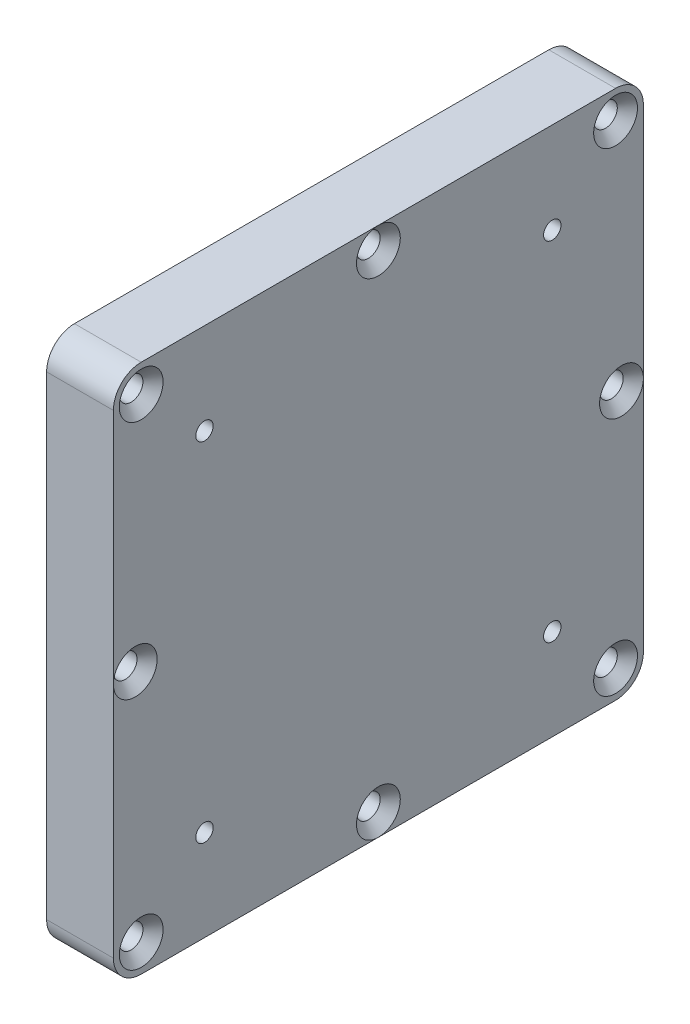
ISO-10303-21;
HEADER;
FILE_DESCRIPTION(('STEP AP214'),'2;1');
FILE_NAME('part.step','',(''),(''),'','','');
FILE_SCHEMA(('AUTOMOTIVE_DESIGN { 1 0 10303 214 1 1 1 1 }'));
ENDSEC;
DATA;
#1=APPLICATION_CONTEXT('core data for automotive mechanical design processes');
#2=APPLICATION_PROTOCOL_DEFINITION('international standard','automotive_design',2000,#1);
#3=PRODUCT_CONTEXT('',#1,'mechanical');
#4=PRODUCT('Part','Part','',(#3));
#5=PRODUCT_RELATED_PRODUCT_CATEGORY('part','',(#4));
#6=PRODUCT_DEFINITION_FORMATION('','',#4);
#7=PRODUCT_DEFINITION_CONTEXT('part definition',#1,'design');
#8=PRODUCT_DEFINITION('design','',#6,#7);
#9=PRODUCT_DEFINITION_SHAPE('','',#8);
#10=(LENGTH_UNIT() NAMED_UNIT(*) SI_UNIT(.MILLI.,.METRE.));
#11=(NAMED_UNIT(*) PLANE_ANGLE_UNIT() SI_UNIT($,.RADIAN.));
#12=(NAMED_UNIT(*) SI_UNIT($,.STERADIAN.) SOLID_ANGLE_UNIT());
#13=UNCERTAINTY_MEASURE_WITH_UNIT(LENGTH_MEASURE(1.E-05),#10,'distance_accuracy_value','');
#14=(GEOMETRIC_REPRESENTATION_CONTEXT(3) GLOBAL_UNCERTAINTY_ASSIGNED_CONTEXT((#13)) GLOBAL_UNIT_ASSIGNED_CONTEXT((#10,
#11,#12)) REPRESENTATION_CONTEXT('',''));
#15=CARTESIAN_POINT('',(0.,0.,0.));
#16=DIRECTION('',(0.,0.,1.));
#17=DIRECTION('',(1.,0.,0.));
#18=AXIS2_PLACEMENT_3D('',#15,#16,#17);
#19=CARTESIAN_POINT('',(9.6,-34.1,34.1));
#20=DIRECTION('',(-1.,0.,0.));
#21=DIRECTION('',(0.,0.,1.));
#22=AXIS2_PLACEMENT_3D('',#19,#20,#21);
#23=PLANE('',#22);
#24=CARTESIAN_POINT('',(9.6,25.,25.));
#25=DIRECTION('',(1.,0.,0.));
#26=DIRECTION('',(0.,0.,-1.));
#27=AXIS2_PLACEMENT_3D('',#24,#25,#26);
#28=CIRCLE('',#27,1.24999999999999);
#29=CARTESIAN_POINT('',(9.6,25.,23.75));
#30=VERTEX_POINT('',#29);
#31=EDGE_CURVE('E141',#30,#30,#28,.T.);
#32=ORIENTED_EDGE('',*,*,#31,.F.);
#33=EDGE_LOOP('',(#32));
#34=FACE_BOUND('',#33,.T.);
#35=CARTESIAN_POINT('',(9.6,25.,-25.));
#36=DIRECTION('',(1.,0.,0.));
#37=DIRECTION('',(0.,0.,-1.));
#38=AXIS2_PLACEMENT_3D('',#35,#36,#37);
#39=CIRCLE('',#38,1.24999999999999);
#40=CARTESIAN_POINT('',(9.6,25.,-26.25));
#41=VERTEX_POINT('',#40);
#42=EDGE_CURVE('E140',#41,#41,#39,.T.);
#43=ORIENTED_EDGE('',*,*,#42,.F.);
#44=EDGE_LOOP('',(#43));
#45=FACE_BOUND('',#44,.T.);
#46=CARTESIAN_POINT('',(9.6,-25.,-25.));
#47=DIRECTION('',(1.,0.,0.));
#48=DIRECTION('',(0.,0.,-1.));
#49=AXIS2_PLACEMENT_3D('',#46,#47,#48);
#50=CIRCLE('',#49,1.24999999999999);
#51=CARTESIAN_POINT('',(9.6,-25.,-26.25));
#52=VERTEX_POINT('',#51);
#53=EDGE_CURVE('E151',#52,#52,#50,.T.);
#54=ORIENTED_EDGE('',*,*,#53,.F.);
#55=EDGE_LOOP('',(#54));
#56=FACE_BOUND('',#55,.T.);
#57=CARTESIAN_POINT('',(9.6,34.1,-34.100008));
#58=DIRECTION('',(1.,0.,0.));
#59=DIRECTION('',(0.,0.,-1.));
#60=AXIS2_PLACEMENT_3D('',#57,#58,#59);
#61=CIRCLE('',#60,3.15);
#62=CARTESIAN_POINT('',(9.6,34.1,-37.250008));
#63=VERTEX_POINT('',#62);
#64=EDGE_CURVE('E163',#63,#63,#61,.T.);
#65=ORIENTED_EDGE('',*,*,#64,.F.);
#66=EDGE_LOOP('',(#65));
#67=FACE_BOUND('',#66,.T.);
#68=CARTESIAN_POINT('',(9.6,34.1,34.1));
#69=DIRECTION('',(1.,0.,0.));
#70=DIRECTION('',(0.,0.,-1.));
#71=AXIS2_PLACEMENT_3D('',#68,#69,#70);
#72=CIRCLE('',#71,3.15);
#73=CARTESIAN_POINT('',(9.6,34.1,30.95));
#74=VERTEX_POINT('',#73);
#75=EDGE_CURVE('E172',#74,#74,#72,.T.);
#76=ORIENTED_EDGE('',*,*,#75,.F.);
#77=EDGE_LOOP('',(#76));
#78=FACE_BOUND('',#77,.T.);
#79=CARTESIAN_POINT('',(9.6,-34.1,34.1));
#80=DIRECTION('',(1.,0.,0.));
#81=DIRECTION('',(0.,0.,-1.));
#82=AXIS2_PLACEMENT_3D('',#79,#80,#81);
#83=CIRCLE('',#82,3.15);
#84=CARTESIAN_POINT('',(9.6,-34.1,30.95));
#85=VERTEX_POINT('',#84);
#86=EDGE_CURVE('E181',#85,#85,#83,.T.);
#87=ORIENTED_EDGE('',*,*,#86,.F.);
#88=EDGE_LOOP('',(#87));
#89=FACE_BOUND('',#88,.T.);
#90=CARTESIAN_POINT('',(9.6,-34.1,-34.100008));
#91=DIRECTION('',(1.,0.,0.));
#92=DIRECTION('',(0.,0.,-1.));
#93=AXIS2_PLACEMENT_3D('',#90,#91,#92);
#94=CIRCLE('',#93,3.15);
#95=CARTESIAN_POINT('',(9.6,-34.1,-37.250008));
#96=VERTEX_POINT('',#95);
#97=EDGE_CURVE('E190',#96,#96,#94,.T.);
#98=ORIENTED_EDGE('',*,*,#97,.F.);
#99=EDGE_LOOP('',(#98));
#100=FACE_BOUND('',#99,.T.);
#101=DIRECTION('',(0.,0.,1.));
#102=VECTOR('',#101,1.);
#103=CARTESIAN_POINT('',(9.6,38.1,34.1));
#104=LINE('',#103,#102);
#105=CARTESIAN_POINT('',(9.6,38.1,-34.1));
#106=VERTEX_POINT('',#105);
#107=CARTESIAN_POINT('',(9.6,38.1,0.));
#108=VERTEX_POINT('',#107);
#109=EDGE_CURVE('E247',#106,#108,#104,.T.);
#110=ORIENTED_EDGE('',*,*,#109,.T.);
#111=CARTESIAN_POINT('',(9.6,34.94999995,0.));
#112=DIRECTION('',(1.,0.,0.));
#113=DIRECTION('',(0.,0.,-1.));
#114=AXIS2_PLACEMENT_3D('',#111,#112,#113);
#115=CIRCLE('',#114,3.15);
#116=EDGE_CURVE('E58',#108,#108,#115,.T.);
#117=ORIENTED_EDGE('',*,*,#116,.F.);
#118=CARTESIAN_POINT('',(9.6,38.1,34.1));
#119=VERTEX_POINT('',#118);
#120=EDGE_CURVE('E246',#108,#119,#104,.T.);
#121=ORIENTED_EDGE('',*,*,#120,.T.);
#122=CARTESIAN_POINT('',(9.6,34.1,34.1));
#123=DIRECTION('',(1.,0.,0.));
#124=DIRECTION('',(0.,0.,1.));
#125=AXIS2_PLACEMENT_3D('',#122,#123,#124);
#126=CIRCLE('',#125,4.00000000000001);
#127=CARTESIAN_POINT('',(9.6,34.1,38.1));
#128=VERTEX_POINT('',#127);
#129=EDGE_CURVE('E250',#119,#128,#126,.T.);
#130=ORIENTED_EDGE('',*,*,#129,.T.);
#131=DIRECTION('',(0.,-1.,0.));
#132=VECTOR('',#131,1.);
#133=CARTESIAN_POINT('',(9.6,-34.1,38.1));
#134=LINE('',#133,#132);
#135=CARTESIAN_POINT('',(9.6,0.,38.1));
#136=VERTEX_POINT('',#135);
#137=EDGE_CURVE('E253',#128,#136,#134,.T.);
#138=ORIENTED_EDGE('',*,*,#137,.T.);
#139=CARTESIAN_POINT('',(9.6,0.,34.95));
#140=DIRECTION('',(1.,0.,0.));
#141=DIRECTION('',(0.,0.,-1.));
#142=AXIS2_PLACEMENT_3D('',#139,#140,#141);
#143=CIRCLE('',#142,3.15);
#144=EDGE_CURVE('E63',#136,#136,#143,.T.);
#145=ORIENTED_EDGE('',*,*,#144,.F.);
#146=CARTESIAN_POINT('',(9.6,-34.1,38.1));
#147=VERTEX_POINT('',#146);
#148=EDGE_CURVE('E252',#136,#147,#134,.T.);
#149=ORIENTED_EDGE('',*,*,#148,.T.);
#150=CARTESIAN_POINT('',(9.6,-34.1,34.1));
#151=DIRECTION('',(1.,0.,0.));
#152=DIRECTION('',(0.,0.,1.));
#153=AXIS2_PLACEMENT_3D('',#150,#151,#152);
#154=CIRCLE('',#153,4.);
#155=CARTESIAN_POINT('',(9.6,-38.1,34.1));
#156=VERTEX_POINT('',#155);
#157=EDGE_CURVE('E230',#147,#156,#154,.T.);
#158=ORIENTED_EDGE('',*,*,#157,.T.);
#159=DIRECTION('',(0.,0.,-1.));
#160=VECTOR('',#159,1.);
#161=CARTESIAN_POINT('',(9.6,-38.1,34.1));
#162=LINE('',#161,#160);
#163=CARTESIAN_POINT('',(9.6,-38.1,0.));
#164=VERTEX_POINT('',#163);
#165=EDGE_CURVE('E235',#156,#164,#162,.T.);
#166=ORIENTED_EDGE('',*,*,#165,.T.);
#167=CARTESIAN_POINT('',(9.6,-34.95,0.));
#168=DIRECTION('',(1.,0.,0.));
#169=DIRECTION('',(0.,0.,-1.));
#170=AXIS2_PLACEMENT_3D('',#167,#168,#169);
#171=CIRCLE('',#170,3.15);
#172=EDGE_CURVE('E213',#164,#164,#171,.T.);
#173=ORIENTED_EDGE('',*,*,#172,.F.);
#174=CARTESIAN_POINT('',(9.6,-38.1,-34.1));
#175=VERTEX_POINT('',#174);
#176=EDGE_CURVE('E233',#164,#175,#162,.T.);
#177=ORIENTED_EDGE('',*,*,#176,.T.);
#178=CARTESIAN_POINT('',(9.6,-34.1,-34.1));
#179=DIRECTION('',(1.,0.,0.));
#180=DIRECTION('',(0.,0.,-1.));
#181=AXIS2_PLACEMENT_3D('',#178,#179,#180);
#182=CIRCLE('',#181,4.);
#183=CARTESIAN_POINT('',(9.6,-34.1,-38.1));
#184=VERTEX_POINT('',#183);
#185=EDGE_CURVE('E238',#175,#184,#182,.T.);
#186=ORIENTED_EDGE('',*,*,#185,.T.);
#187=DIRECTION('',(0.,1.,0.));
#188=VECTOR('',#187,1.);
#189=CARTESIAN_POINT('',(9.6,-34.1,-38.1));
#190=LINE('',#189,#188);
#191=CARTESIAN_POINT('',(9.6,0.,-38.1));
#192=VERTEX_POINT('',#191);
#193=EDGE_CURVE('E241',#184,#192,#190,.T.);
#194=ORIENTED_EDGE('',*,*,#193,.T.);
#195=CARTESIAN_POINT('',(9.6,0.,-34.95));
#196=DIRECTION('',(1.,0.,0.));
#197=DIRECTION('',(0.,0.,-1.));
#198=AXIS2_PLACEMENT_3D('',#195,#196,#197);
#199=CIRCLE('',#198,3.15);
#200=EDGE_CURVE('E221',#192,#192,#199,.T.);
#201=ORIENTED_EDGE('',*,*,#200,.F.);
#202=CARTESIAN_POINT('',(9.6,34.1,-38.1));
#203=VERTEX_POINT('',#202);
#204=EDGE_CURVE('E240',#192,#203,#190,.T.);
#205=ORIENTED_EDGE('',*,*,#204,.T.);
#206=CARTESIAN_POINT('',(9.6,34.1,-34.1));
#207=DIRECTION('',(1.,0.,0.));
#208=DIRECTION('',(0.,0.,1.));
#209=AXIS2_PLACEMENT_3D('',#206,#207,#208);
#210=CIRCLE('',#209,4.00000000000001);
#211=EDGE_CURVE('E244',#203,#106,#210,.T.);
#212=ORIENTED_EDGE('',*,*,#211,.T.);
#213=EDGE_LOOP('',(#110,#117,#121,#130,#138,#145,#149,#158,#166,#173,#177,#186,#194,#201,#205,#212));
#214=FACE_BOUND('',#213,.T.);
#215=CARTESIAN_POINT('',(9.6,-25.,25.));
#216=DIRECTION('',(1.,0.,0.));
#217=DIRECTION('',(0.,0.,-1.));
#218=AXIS2_PLACEMENT_3D('',#215,#216,#217);
#219=CIRCLE('',#218,1.24999999999999);
#220=CARTESIAN_POINT('',(9.6,-25.,23.75));
#221=VERTEX_POINT('',#220);
#222=EDGE_CURVE('E157',#221,#221,#219,.T.);
#223=ORIENTED_EDGE('',*,*,#222,.F.);
#224=EDGE_LOOP('',(#223));
#225=FACE_BOUND('',#224,.T.);
#226=ADVANCED_FACE('F45',(#34,#45,#56,#67,#78,#89,#100,#214,#225),#23,.F.);
#227=CARTESIAN_POINT('',(9.6,-34.1,34.1));
#228=DIRECTION('',(-1.,0.,0.));
#229=DIRECTION('',(0.,0.,1.));
#230=AXIS2_PLACEMENT_3D('',#227,#228,#229);
#231=CYLINDRICAL_SURFACE('',#230,4.);
#232=CARTESIAN_POINT('',(0.,-34.1,34.1));
#233=DIRECTION('',(1.,0.,0.));
#234=DIRECTION('',(0.,0.,1.));
#235=AXIS2_PLACEMENT_3D('',#232,#233,#234);
#236=CIRCLE('',#235,4.);
#237=CARTESIAN_POINT('',(0.,-34.1,38.1));
#238=VERTEX_POINT('',#237);
#239=CARTESIAN_POINT('',(0.,-38.1,34.1));
#240=VERTEX_POINT('',#239);
#241=EDGE_CURVE('E229',#238,#240,#236,.T.);
#242=ORIENTED_EDGE('',*,*,#241,.T.);
#243=DIRECTION('',(-1.,0.,0.));
#244=VECTOR('',#243,1.);
#245=CARTESIAN_POINT('',(9.6,-38.1,34.1));
#246=LINE('',#245,#244);
#247=EDGE_CURVE('E11',#156,#240,#246,.T.);
#248=ORIENTED_EDGE('',*,*,#247,.F.);
#249=ORIENTED_EDGE('',*,*,#157,.F.);
#250=DIRECTION('',(-1.,0.,0.));
#251=VECTOR('',#250,1.);
#252=CARTESIAN_POINT('',(9.6,-34.1,38.1));
#253=LINE('',#252,#251);
#254=EDGE_CURVE('E256',#147,#238,#253,.T.);
#255=ORIENTED_EDGE('',*,*,#254,.T.);
#256=EDGE_LOOP('',(#242,#248,#249,#255));
#257=FACE_BOUND('',#256,.T.);
#258=ADVANCED_FACE('F47',(#257),#231,.T.);
#259=CARTESIAN_POINT('',(9.6,-38.1,34.1));
#260=DIRECTION('',(0.,1.,0.));
#261=DIRECTION('',(0.,0.,1.));
#262=AXIS2_PLACEMENT_3D('',#259,#260,#261);
#263=PLANE('',#262);
#264=DIRECTION('',(0.,0.,-1.));
#265=VECTOR('',#264,1.);
#266=CARTESIAN_POINT('',(0.,-38.1,34.1));
#267=LINE('',#266,#265);
#268=CARTESIAN_POINT('',(0.,-38.1,-34.1));
#269=VERTEX_POINT('',#268);
#270=EDGE_CURVE('E259',#240,#269,#267,.T.);
#271=ORIENTED_EDGE('',*,*,#270,.T.);
#272=DIRECTION('',(-1.,0.,0.));
#273=VECTOR('',#272,1.);
#274=CARTESIAN_POINT('',(9.6,-38.1,-34.1));
#275=LINE('',#274,#273);
#276=EDGE_CURVE('E53',#175,#269,#275,.T.);
#277=ORIENTED_EDGE('',*,*,#276,.F.);
#278=ORIENTED_EDGE('',*,*,#176,.F.);
#279=ORIENTED_EDGE('',*,*,#165,.F.);
#280=ORIENTED_EDGE('',*,*,#247,.T.);
#281=EDGE_LOOP('',(#271,#277,#278,#279,#280));
#282=FACE_BOUND('',#281,.T.);
#283=ADVANCED_FACE('F317',(#282),#263,.F.);
#284=CARTESIAN_POINT('',(9.6,-34.1,-34.1));
#285=DIRECTION('',(-1.,0.,0.));
#286=DIRECTION('',(0.,0.,1.));
#287=AXIS2_PLACEMENT_3D('',#284,#285,#286);
#288=CYLINDRICAL_SURFACE('',#287,4.);
#289=CARTESIAN_POINT('',(0.,-34.1,-34.1));
#290=DIRECTION('',(1.,0.,0.));
#291=DIRECTION('',(0.,0.,-1.));
#292=AXIS2_PLACEMENT_3D('',#289,#290,#291);
#293=CIRCLE('',#292,4.);
#294=CARTESIAN_POINT('',(0.,-34.1,-38.1));
#295=VERTEX_POINT('',#294);
#296=EDGE_CURVE('E261',#269,#295,#293,.T.);
#297=ORIENTED_EDGE('',*,*,#296,.T.);
#298=DIRECTION('',(-1.,0.,0.));
#299=VECTOR('',#298,1.);
#300=CARTESIAN_POINT('',(9.6,-34.1,-38.1));
#301=LINE('',#300,#299);
#302=EDGE_CURVE('E286',#184,#295,#301,.T.);
#303=ORIENTED_EDGE('',*,*,#302,.F.);
#304=ORIENTED_EDGE('',*,*,#185,.F.);
#305=ORIENTED_EDGE('',*,*,#276,.T.);
#306=EDGE_LOOP('',(#297,#303,#304,#305));
#307=FACE_BOUND('',#306,.T.);
#308=ADVANCED_FACE('F293',(#307),#288,.T.);
#309=CARTESIAN_POINT('',(9.6,-34.1,-38.1));
#310=DIRECTION('',(0.,0.,1.));
#311=DIRECTION('',(1.,0.,0.));
#312=AXIS2_PLACEMENT_3D('',#309,#310,#311);
#313=PLANE('',#312);
#314=DIRECTION('',(0.,1.,0.));
#315=VECTOR('',#314,1.);
#316=CARTESIAN_POINT('',(0.,-34.1,-38.1));
#317=LINE('',#316,#315);
#318=CARTESIAN_POINT('',(0.,34.1,-38.1));
#319=VERTEX_POINT('',#318);
#320=EDGE_CURVE('E263',#295,#319,#317,.T.);
#321=ORIENTED_EDGE('',*,*,#320,.T.);
#322=DIRECTION('',(-1.,0.,0.));
#323=VECTOR('',#322,1.);
#324=CARTESIAN_POINT('',(9.6,34.1,-38.1));
#325=LINE('',#324,#323);
#326=EDGE_CURVE('E283',#203,#319,#325,.T.);
#327=ORIENTED_EDGE('',*,*,#326,.F.);
#328=ORIENTED_EDGE('',*,*,#204,.F.);
#329=ORIENTED_EDGE('',*,*,#193,.F.);
#330=ORIENTED_EDGE('',*,*,#302,.T.);
#331=EDGE_LOOP('',(#321,#327,#328,#329,#330));
#332=FACE_BOUND('',#331,.T.);
#333=ADVANCED_FACE('F305',(#332),#313,.F.);
#334=CARTESIAN_POINT('',(9.6,34.1,-34.1));
#335=DIRECTION('',(-1.,0.,0.));
#336=DIRECTION('',(0.,0.,1.));
#337=AXIS2_PLACEMENT_3D('',#334,#335,#336);
#338=CYLINDRICAL_SURFACE('',#337,4.00000000000001);
#339=CARTESIAN_POINT('',(0.,34.1,-34.1));
#340=DIRECTION('',(1.,0.,0.));
#341=DIRECTION('',(0.,0.,1.));
#342=AXIS2_PLACEMENT_3D('',#339,#340,#341);
#343=CIRCLE('',#342,4.00000000000001);
#344=CARTESIAN_POINT('',(0.,38.1,-34.1));
#345=VERTEX_POINT('',#344);
#346=EDGE_CURVE('E265',#319,#345,#343,.T.);
#347=ORIENTED_EDGE('',*,*,#346,.T.);
#348=DIRECTION('',(-1.,0.,0.));
#349=VECTOR('',#348,1.);
#350=CARTESIAN_POINT('',(9.6,38.1,-34.1));
#351=LINE('',#350,#349);
#352=EDGE_CURVE('E280',#106,#345,#351,.T.);
#353=ORIENTED_EDGE('',*,*,#352,.F.);
#354=ORIENTED_EDGE('',*,*,#211,.F.);
#355=ORIENTED_EDGE('',*,*,#326,.T.);
#356=EDGE_LOOP('',(#347,#353,#354,#355));
#357=FACE_BOUND('',#356,.T.);
#358=ADVANCED_FACE('F310',(#357),#338,.T.);
#359=CARTESIAN_POINT('',(9.6,38.1,34.1));
#360=DIRECTION('',(0.,-1.,0.));
#361=DIRECTION('',(0.,0.,-1.));
#362=AXIS2_PLACEMENT_3D('',#359,#360,#361);
#363=PLANE('',#362);
#364=DIRECTION('',(0.,0.,1.));
#365=VECTOR('',#364,1.);
#366=CARTESIAN_POINT('',(0.,38.1,34.1));
#367=LINE('',#366,#365);
#368=CARTESIAN_POINT('',(0.,38.1,34.1));
#369=VERTEX_POINT('',#368);
#370=EDGE_CURVE('E267',#345,#369,#367,.T.);
#371=ORIENTED_EDGE('',*,*,#370,.T.);
#372=DIRECTION('',(-1.,0.,0.));
#373=VECTOR('',#372,1.);
#374=CARTESIAN_POINT('',(9.6,38.1,34.1));
#375=LINE('',#374,#373);
#376=EDGE_CURVE('E277',#119,#369,#375,.T.);
#377=ORIENTED_EDGE('',*,*,#376,.F.);
#378=ORIENTED_EDGE('',*,*,#120,.F.);
#379=ORIENTED_EDGE('',*,*,#109,.F.);
#380=ORIENTED_EDGE('',*,*,#352,.T.);
#381=EDGE_LOOP('',(#371,#377,#378,#379,#380));
#382=FACE_BOUND('',#381,.T.);
#383=ADVANCED_FACE('F335',(#382),#363,.F.);
#384=CARTESIAN_POINT('',(9.6,34.1,34.1));
#385=DIRECTION('',(-1.,0.,0.));
#386=DIRECTION('',(0.,0.,1.));
#387=AXIS2_PLACEMENT_3D('',#384,#385,#386);
#388=CYLINDRICAL_SURFACE('',#387,4.00000000000001);
#389=CARTESIAN_POINT('',(0.,34.1,34.1));
#390=DIRECTION('',(1.,0.,0.));
#391=DIRECTION('',(0.,0.,1.));
#392=AXIS2_PLACEMENT_3D('',#389,#390,#391);
#393=CIRCLE('',#392,4.00000000000001);
#394=CARTESIAN_POINT('',(0.,34.1,38.1));
#395=VERTEX_POINT('',#394);
#396=EDGE_CURVE('E269',#369,#395,#393,.T.);
#397=ORIENTED_EDGE('',*,*,#396,.T.);
#398=DIRECTION('',(-1.,0.,0.));
#399=VECTOR('',#398,1.);
#400=CARTESIAN_POINT('',(9.6,34.1,38.1));
#401=LINE('',#400,#399);
#402=EDGE_CURVE('E274',#128,#395,#401,.T.);
#403=ORIENTED_EDGE('',*,*,#402,.F.);
#404=ORIENTED_EDGE('',*,*,#129,.F.);
#405=ORIENTED_EDGE('',*,*,#376,.T.);
#406=EDGE_LOOP('',(#397,#403,#404,#405));
#407=FACE_BOUND('',#406,.T.);
#408=ADVANCED_FACE('F331',(#407),#388,.T.);
#409=CARTESIAN_POINT('',(9.6,-34.1,38.1));
#410=DIRECTION('',(0.,0.,-1.));
#411=DIRECTION('',(-1.,0.,0.));
#412=AXIS2_PLACEMENT_3D('',#409,#410,#411);
#413=PLANE('',#412);
#414=DIRECTION('',(0.,-1.,0.));
#415=VECTOR('',#414,1.);
#416=CARTESIAN_POINT('',(0.,-34.1,38.1));
#417=LINE('',#416,#415);
#418=EDGE_CURVE('E234',#395,#238,#417,.T.);
#419=ORIENTED_EDGE('',*,*,#418,.T.);
#420=ORIENTED_EDGE('',*,*,#254,.F.);
#421=ORIENTED_EDGE('',*,*,#148,.F.);
#422=ORIENTED_EDGE('',*,*,#137,.F.);
#423=ORIENTED_EDGE('',*,*,#402,.T.);
#424=EDGE_LOOP('',(#419,#420,#421,#422,#423));
#425=FACE_BOUND('',#424,.T.);
#426=ADVANCED_FACE('F326',(#425),#413,.F.);
#427=CARTESIAN_POINT('',(0.,-34.1,34.1));
#428=DIRECTION('',(-1.,0.,0.));
#429=DIRECTION('',(0.,0.,1.));
#430=AXIS2_PLACEMENT_3D('',#427,#428,#429);
#431=PLANE('',#430);
#432=CARTESIAN_POINT('',(0.,34.1,-34.100008));
#433=DIRECTION('',(1.,0.,0.));
#434=DIRECTION('',(0.,0.,-1.));
#435=AXIS2_PLACEMENT_3D('',#432,#433,#434);
#436=CIRCLE('',#435,1.7);
#437=CARTESIAN_POINT('',(0.,34.1,-35.800008));
#438=VERTEX_POINT('',#437);
#439=EDGE_CURVE('E169',#438,#438,#436,.T.);
#440=ORIENTED_EDGE('',*,*,#439,.T.);
#441=EDGE_LOOP('',(#440));
#442=FACE_BOUND('',#441,.T.);
#443=CARTESIAN_POINT('',(0.,34.1,34.1));
#444=DIRECTION('',(1.,0.,0.));
#445=DIRECTION('',(0.,0.,-1.));
#446=AXIS2_PLACEMENT_3D('',#443,#444,#445);
#447=CIRCLE('',#446,1.7);
#448=CARTESIAN_POINT('',(0.,34.1,32.4));
#449=VERTEX_POINT('',#448);
#450=EDGE_CURVE('E178',#449,#449,#447,.T.);
#451=ORIENTED_EDGE('',*,*,#450,.T.);
#452=EDGE_LOOP('',(#451));
#453=FACE_BOUND('',#452,.T.);
#454=CARTESIAN_POINT('',(0.,-34.1,34.1));
#455=DIRECTION('',(1.,0.,0.));
#456=DIRECTION('',(0.,0.,-1.));
#457=AXIS2_PLACEMENT_3D('',#454,#455,#456);
#458=CIRCLE('',#457,1.7);
#459=CARTESIAN_POINT('',(0.,-34.1,32.4));
#460=VERTEX_POINT('',#459);
#461=EDGE_CURVE('E187',#460,#460,#458,.T.);
#462=ORIENTED_EDGE('',*,*,#461,.T.);
#463=EDGE_LOOP('',(#462));
#464=FACE_BOUND('',#463,.T.);
#465=CARTESIAN_POINT('',(0.,-34.1,-34.100008));
#466=DIRECTION('',(1.,0.,0.));
#467=DIRECTION('',(0.,0.,-1.));
#468=AXIS2_PLACEMENT_3D('',#465,#466,#467);
#469=CIRCLE('',#468,1.7);
#470=CARTESIAN_POINT('',(0.,-34.1,-35.800008));
#471=VERTEX_POINT('',#470);
#472=EDGE_CURVE('E196',#471,#471,#469,.T.);
#473=ORIENTED_EDGE('',*,*,#472,.T.);
#474=EDGE_LOOP('',(#473));
#475=FACE_BOUND('',#474,.T.);
#476=CARTESIAN_POINT('',(0.,34.94999995,0.));
#477=DIRECTION('',(1.,0.,0.));
#478=DIRECTION('',(0.,0.,-1.));
#479=AXIS2_PLACEMENT_3D('',#476,#477,#478);
#480=CIRCLE('',#479,1.7);
#481=CARTESIAN_POINT('',(0.,34.94999995,-1.70000000000001));
#482=VERTEX_POINT('',#481);
#483=EDGE_CURVE('E203',#482,#482,#480,.T.);
#484=ORIENTED_EDGE('',*,*,#483,.T.);
#485=EDGE_LOOP('',(#484));
#486=FACE_BOUND('',#485,.T.);
#487=CARTESIAN_POINT('',(0.,0.,34.95));
#488=DIRECTION('',(1.,0.,0.));
#489=DIRECTION('',(0.,0.,-1.));
#490=AXIS2_PLACEMENT_3D('',#487,#488,#489);
#491=CIRCLE('',#490,1.7);
#492=CARTESIAN_POINT('',(0.,0.,33.25));
#493=VERTEX_POINT('',#492);
#494=EDGE_CURVE('E210',#493,#493,#491,.T.);
#495=ORIENTED_EDGE('',*,*,#494,.T.);
#496=EDGE_LOOP('',(#495));
#497=FACE_BOUND('',#496,.T.);
#498=CARTESIAN_POINT('',(0.,-34.95,0.));
#499=DIRECTION('',(1.,0.,0.));
#500=DIRECTION('',(0.,0.,-1.));
#501=AXIS2_PLACEMENT_3D('',#498,#499,#500);
#502=CIRCLE('',#501,1.7);
#503=CARTESIAN_POINT('',(0.,-34.95,-1.70000000000001));
#504=VERTEX_POINT('',#503);
#505=EDGE_CURVE('E218',#504,#504,#502,.T.);
#506=ORIENTED_EDGE('',*,*,#505,.T.);
#507=EDGE_LOOP('',(#506));
#508=FACE_BOUND('',#507,.T.);
#509=CARTESIAN_POINT('',(0.,0.,-34.95));
#510=DIRECTION('',(1.,0.,0.));
#511=DIRECTION('',(0.,0.,-1.));
#512=AXIS2_PLACEMENT_3D('',#509,#510,#511);
#513=CIRCLE('',#512,1.7);
#514=CARTESIAN_POINT('',(0.,0.,-36.65));
#515=VERTEX_POINT('',#514);
#516=EDGE_CURVE('E226',#515,#515,#513,.T.);
#517=ORIENTED_EDGE('',*,*,#516,.T.);
#518=EDGE_LOOP('',(#517));
#519=FACE_BOUND('',#518,.T.);
#520=ORIENTED_EDGE('',*,*,#241,.F.);
#521=ORIENTED_EDGE('',*,*,#418,.F.);
#522=ORIENTED_EDGE('',*,*,#396,.F.);
#523=ORIENTED_EDGE('',*,*,#370,.F.);
#524=ORIENTED_EDGE('',*,*,#346,.F.);
#525=ORIENTED_EDGE('',*,*,#320,.F.);
#526=ORIENTED_EDGE('',*,*,#296,.F.);
#527=ORIENTED_EDGE('',*,*,#270,.F.);
#528=EDGE_LOOP('',(#520,#521,#522,#523,#524,#525,#526,#527));
#529=FACE_BOUND('',#528,.T.);
#530=ADVANCED_FACE('F300',(#442,#453,#464,#475,#486,#497,#508,#519,#529),#431,.T.);
#531=CARTESIAN_POINT('',(9.6,0.,-34.95));
#532=DIRECTION('',(1.,0.,0.));
#533=DIRECTION('',(0.,0.,-1.));
#534=AXIS2_PLACEMENT_3D('',#531,#532,#533);
#535=CYLINDRICAL_SURFACE('',#534,1.7);
#536=ORIENTED_EDGE('',*,*,#516,.F.);
#537=EDGE_LOOP('',(#536));
#538=FACE_BOUND('',#537,.T.);
#539=CARTESIAN_POINT('',(8.15,0.,-34.95));
#540=DIRECTION('',(1.,0.,0.));
#541=DIRECTION('',(0.,0.,-1.));
#542=AXIS2_PLACEMENT_3D('',#539,#540,#541);
#543=CIRCLE('',#542,1.7);
#544=CARTESIAN_POINT('',(8.15,0.,-36.65));
#545=VERTEX_POINT('',#544);
#546=EDGE_CURVE('E223',#545,#545,#543,.T.);
#547=ORIENTED_EDGE('',*,*,#546,.T.);
#548=EDGE_LOOP('',(#547));
#549=FACE_BOUND('',#548,.T.);
#550=ADVANCED_FACE('F358',(#538,#549),#535,.F.);
#551=CARTESIAN_POINT('',(9.6,0.,-34.95));
#552=DIRECTION('',(1.,0.,0.));
#553=DIRECTION('',(0.,0.,-1.));
#554=AXIS2_PLACEMENT_3D('',#551,#552,#553);
#555=CONICAL_SURFACE('',#554,3.15,0.785398163397448);
#556=ORIENTED_EDGE('',*,*,#546,.F.);
#557=EDGE_LOOP('',(#556));
#558=FACE_BOUND('',#557,.T.);
#559=ORIENTED_EDGE('',*,*,#200,.T.);
#560=EDGE_LOOP('',(#559));
#561=FACE_BOUND('',#560,.T.);
#562=ADVANCED_FACE('F378',(#558,#561),#555,.F.);
#563=CARTESIAN_POINT('',(9.6,-34.95,0.));
#564=DIRECTION('',(1.,0.,0.));
#565=DIRECTION('',(0.,0.,-1.));
#566=AXIS2_PLACEMENT_3D('',#563,#564,#565);
#567=CYLINDRICAL_SURFACE('',#566,1.7);
#568=ORIENTED_EDGE('',*,*,#505,.F.);
#569=EDGE_LOOP('',(#568));
#570=FACE_BOUND('',#569,.T.);
#571=CARTESIAN_POINT('',(8.15,-34.95,0.));
#572=DIRECTION('',(1.,0.,0.));
#573=DIRECTION('',(0.,0.,-1.));
#574=AXIS2_PLACEMENT_3D('',#571,#572,#573);
#575=CIRCLE('',#574,1.7);
#576=CARTESIAN_POINT('',(8.15,-34.95,-1.70000000000001));
#577=VERTEX_POINT('',#576);
#578=EDGE_CURVE('E215',#577,#577,#575,.T.);
#579=ORIENTED_EDGE('',*,*,#578,.T.);
#580=EDGE_LOOP('',(#579));
#581=FACE_BOUND('',#580,.T.);
#582=ADVANCED_FACE('F386',(#570,#581),#567,.F.);
#583=CARTESIAN_POINT('',(9.6,-34.95,0.));
#584=DIRECTION('',(1.,0.,0.));
#585=DIRECTION('',(0.,0.,-1.));
#586=AXIS2_PLACEMENT_3D('',#583,#584,#585);
#587=CONICAL_SURFACE('',#586,3.15,0.785398163397447);
#588=ORIENTED_EDGE('',*,*,#578,.F.);
#589=EDGE_LOOP('',(#588));
#590=FACE_BOUND('',#589,.T.);
#591=ORIENTED_EDGE('',*,*,#172,.T.);
#592=EDGE_LOOP('',(#591));
#593=FACE_BOUND('',#592,.T.);
#594=ADVANCED_FACE('F394',(#590,#593),#587,.F.);
#595=CARTESIAN_POINT('',(9.6,0.,34.95));
#596=DIRECTION('',(1.,0.,0.));
#597=DIRECTION('',(0.,0.,-1.));
#598=AXIS2_PLACEMENT_3D('',#595,#596,#597);
#599=CYLINDRICAL_SURFACE('',#598,1.7);
#600=ORIENTED_EDGE('',*,*,#494,.F.);
#601=EDGE_LOOP('',(#600));
#602=FACE_BOUND('',#601,.T.);
#603=CARTESIAN_POINT('',(8.15,0.,34.95));
#604=DIRECTION('',(1.,0.,0.));
#605=DIRECTION('',(0.,0.,-1.));
#606=AXIS2_PLACEMENT_3D('',#603,#604,#605);
#607=CIRCLE('',#606,1.7);
#608=CARTESIAN_POINT('',(8.15,0.,33.25));
#609=VERTEX_POINT('',#608);
#610=EDGE_CURVE('E207',#609,#609,#607,.T.);
#611=ORIENTED_EDGE('',*,*,#610,.T.);
#612=EDGE_LOOP('',(#611));
#613=FACE_BOUND('',#612,.T.);
#614=ADVANCED_FACE('F403',(#602,#613),#599,.F.);
#615=CARTESIAN_POINT('',(9.6,0.,34.95));
#616=DIRECTION('',(1.,0.,0.));
#617=DIRECTION('',(0.,0.,-1.));
#618=AXIS2_PLACEMENT_3D('',#615,#616,#617);
#619=CONICAL_SURFACE('',#618,3.15,0.785398163397448);
#620=ORIENTED_EDGE('',*,*,#610,.F.);
#621=EDGE_LOOP('',(#620));
#622=FACE_BOUND('',#621,.T.);
#623=ORIENTED_EDGE('',*,*,#144,.T.);
#624=EDGE_LOOP('',(#623));
#625=FACE_BOUND('',#624,.T.);
#626=ADVANCED_FACE('F412',(#622,#625),#619,.F.);
#627=CARTESIAN_POINT('',(9.6,34.94999995,0.));
#628=DIRECTION('',(1.,0.,0.));
#629=DIRECTION('',(0.,0.,-1.));
#630=AXIS2_PLACEMENT_3D('',#627,#628,#629);
#631=CYLINDRICAL_SURFACE('',#630,1.7);
#632=ORIENTED_EDGE('',*,*,#483,.F.);
#633=EDGE_LOOP('',(#632));
#634=FACE_BOUND('',#633,.T.);
#635=CARTESIAN_POINT('',(8.15,34.94999995,0.));
#636=DIRECTION('',(1.,0.,0.));
#637=DIRECTION('',(0.,0.,-1.));
#638=AXIS2_PLACEMENT_3D('',#635,#636,#637);
#639=CIRCLE('',#638,1.7);
#640=CARTESIAN_POINT('',(8.15,34.94999995,-1.70000000000001));
#641=VERTEX_POINT('',#640);
#642=EDGE_CURVE('E200',#641,#641,#639,.T.);
#643=ORIENTED_EDGE('',*,*,#642,.T.);
#644=EDGE_LOOP('',(#643));
#645=FACE_BOUND('',#644,.T.);
#646=ADVANCED_FACE('F421',(#634,#645),#631,.F.);
#647=CARTESIAN_POINT('',(9.6,34.94999995,0.));
#648=DIRECTION('',(1.,0.,0.));
#649=DIRECTION('',(0.,0.,-1.));
#650=AXIS2_PLACEMENT_3D('',#647,#648,#649);
#651=CONICAL_SURFACE('',#650,3.15,0.785398163397447);
#652=ORIENTED_EDGE('',*,*,#642,.F.);
#653=EDGE_LOOP('',(#652));
#654=FACE_BOUND('',#653,.T.);
#655=ORIENTED_EDGE('',*,*,#116,.T.);
#656=EDGE_LOOP('',(#655));
#657=FACE_BOUND('',#656,.T.);
#658=ADVANCED_FACE('F430',(#654,#657),#651,.F.);
#659=CARTESIAN_POINT('',(9.6,-34.1,-34.100008));
#660=DIRECTION('',(1.,0.,0.));
#661=DIRECTION('',(0.,0.,-1.));
#662=AXIS2_PLACEMENT_3D('',#659,#660,#661);
#663=CYLINDRICAL_SURFACE('',#662,1.7);
#664=ORIENTED_EDGE('',*,*,#472,.F.);
#665=EDGE_LOOP('',(#664));
#666=FACE_BOUND('',#665,.T.);
#667=CARTESIAN_POINT('',(8.15,-34.1,-34.100008));
#668=DIRECTION('',(1.,0.,0.));
#669=DIRECTION('',(0.,0.,-1.));
#670=AXIS2_PLACEMENT_3D('',#667,#668,#669);
#671=CIRCLE('',#670,1.7);
#672=CARTESIAN_POINT('',(8.15,-34.1,-35.800008));
#673=VERTEX_POINT('',#672);
#674=EDGE_CURVE('E193',#673,#673,#671,.T.);
#675=ORIENTED_EDGE('',*,*,#674,.T.);
#676=EDGE_LOOP('',(#675));
#677=FACE_BOUND('',#676,.T.);
#678=ADVANCED_FACE('F439',(#666,#677),#663,.F.);
#679=CARTESIAN_POINT('',(9.6,-34.1,-34.100008));
#680=DIRECTION('',(1.,0.,0.));
#681=DIRECTION('',(0.,0.,-1.));
#682=AXIS2_PLACEMENT_3D('',#679,#680,#681);
#683=CONICAL_SURFACE('',#682,3.15,0.785398163397447);
#684=ORIENTED_EDGE('',*,*,#674,.F.);
#685=EDGE_LOOP('',(#684));
#686=FACE_BOUND('',#685,.T.);
#687=ORIENTED_EDGE('',*,*,#97,.T.);
#688=EDGE_LOOP('',(#687));
#689=FACE_BOUND('',#688,.T.);
#690=ADVANCED_FACE('F448',(#686,#689),#683,.F.);
#691=CARTESIAN_POINT('',(9.6,-34.1,34.1));
#692=DIRECTION('',(1.,0.,0.));
#693=DIRECTION('',(0.,0.,-1.));
#694=AXIS2_PLACEMENT_3D('',#691,#692,#693);
#695=CYLINDRICAL_SURFACE('',#694,1.7);
#696=ORIENTED_EDGE('',*,*,#461,.F.);
#697=EDGE_LOOP('',(#696));
#698=FACE_BOUND('',#697,.T.);
#699=CARTESIAN_POINT('',(8.15,-34.1,34.1));
#700=DIRECTION('',(1.,0.,0.));
#701=DIRECTION('',(0.,0.,-1.));
#702=AXIS2_PLACEMENT_3D('',#699,#700,#701);
#703=CIRCLE('',#702,1.7);
#704=CARTESIAN_POINT('',(8.15,-34.1,32.4));
#705=VERTEX_POINT('',#704);
#706=EDGE_CURVE('E184',#705,#705,#703,.T.);
#707=ORIENTED_EDGE('',*,*,#706,.T.);
#708=EDGE_LOOP('',(#707));
#709=FACE_BOUND('',#708,.T.);
#710=ADVANCED_FACE('F457',(#698,#709),#695,.F.);
#711=CARTESIAN_POINT('',(9.6,-34.1,34.1));
#712=DIRECTION('',(1.,0.,0.));
#713=DIRECTION('',(0.,0.,-1.));
#714=AXIS2_PLACEMENT_3D('',#711,#712,#713);
#715=CONICAL_SURFACE('',#714,3.15,0.785398163397447);
#716=ORIENTED_EDGE('',*,*,#706,.F.);
#717=EDGE_LOOP('',(#716));
#718=FACE_BOUND('',#717,.T.);
#719=ORIENTED_EDGE('',*,*,#86,.T.);
#720=EDGE_LOOP('',(#719));
#721=FACE_BOUND('',#720,.T.);
#722=ADVANCED_FACE('F466',(#718,#721),#715,.F.);
#723=CARTESIAN_POINT('',(9.6,34.1,34.1));
#724=DIRECTION('',(1.,0.,0.));
#725=DIRECTION('',(0.,0.,-1.));
#726=AXIS2_PLACEMENT_3D('',#723,#724,#725);
#727=CYLINDRICAL_SURFACE('',#726,1.7);
#728=ORIENTED_EDGE('',*,*,#450,.F.);
#729=EDGE_LOOP('',(#728));
#730=FACE_BOUND('',#729,.T.);
#731=CARTESIAN_POINT('',(8.15,34.1,34.1));
#732=DIRECTION('',(1.,0.,0.));
#733=DIRECTION('',(0.,0.,-1.));
#734=AXIS2_PLACEMENT_3D('',#731,#732,#733);
#735=CIRCLE('',#734,1.7);
#736=CARTESIAN_POINT('',(8.15,34.1,32.4));
#737=VERTEX_POINT('',#736);
#738=EDGE_CURVE('E175',#737,#737,#735,.T.);
#739=ORIENTED_EDGE('',*,*,#738,.T.);
#740=EDGE_LOOP('',(#739));
#741=FACE_BOUND('',#740,.T.);
#742=ADVANCED_FACE('F475',(#730,#741),#727,.F.);
#743=CARTESIAN_POINT('',(9.6,34.1,34.1));
#744=DIRECTION('',(1.,0.,0.));
#745=DIRECTION('',(0.,0.,-1.));
#746=AXIS2_PLACEMENT_3D('',#743,#744,#745);
#747=CONICAL_SURFACE('',#746,3.15,0.785398163397447);
#748=ORIENTED_EDGE('',*,*,#738,.F.);
#749=EDGE_LOOP('',(#748));
#750=FACE_BOUND('',#749,.T.);
#751=ORIENTED_EDGE('',*,*,#75,.T.);
#752=EDGE_LOOP('',(#751));
#753=FACE_BOUND('',#752,.T.);
#754=ADVANCED_FACE('F484',(#750,#753),#747,.F.);
#755=CARTESIAN_POINT('',(9.6,34.1,-34.100008));
#756=DIRECTION('',(1.,0.,0.));
#757=DIRECTION('',(0.,0.,-1.));
#758=AXIS2_PLACEMENT_3D('',#755,#756,#757);
#759=CYLINDRICAL_SURFACE('',#758,1.7);
#760=ORIENTED_EDGE('',*,*,#439,.F.);
#761=EDGE_LOOP('',(#760));
#762=FACE_BOUND('',#761,.T.);
#763=CARTESIAN_POINT('',(8.15,34.1,-34.100008));
#764=DIRECTION('',(1.,0.,0.));
#765=DIRECTION('',(0.,0.,-1.));
#766=AXIS2_PLACEMENT_3D('',#763,#764,#765);
#767=CIRCLE('',#766,1.7);
#768=CARTESIAN_POINT('',(8.15,34.1,-35.800008));
#769=VERTEX_POINT('',#768);
#770=EDGE_CURVE('E166',#769,#769,#767,.T.);
#771=ORIENTED_EDGE('',*,*,#770,.T.);
#772=EDGE_LOOP('',(#771));
#773=FACE_BOUND('',#772,.T.);
#774=ADVANCED_FACE('F493',(#762,#773),#759,.F.);
#775=CARTESIAN_POINT('',(9.6,34.1,-34.100008));
#776=DIRECTION('',(1.,0.,0.));
#777=DIRECTION('',(0.,0.,-1.));
#778=AXIS2_PLACEMENT_3D('',#775,#776,#777);
#779=CONICAL_SURFACE('',#778,3.15,0.785398163397447);
#780=ORIENTED_EDGE('',*,*,#770,.F.);
#781=EDGE_LOOP('',(#780));
#782=FACE_BOUND('',#781,.T.);
#783=ORIENTED_EDGE('',*,*,#64,.T.);
#784=EDGE_LOOP('',(#783));
#785=FACE_BOUND('',#784,.T.);
#786=ADVANCED_FACE('F501',(#782,#785),#779,.F.);
#787=CARTESIAN_POINT('',(2.85107577378445,-25.,25.));
#788=DIRECTION('',(1.,0.,0.));
#789=DIRECTION('',(0.,0.,-1.));
#790=AXIS2_PLACEMENT_3D('',#787,#788,#789);
#791=CONICAL_SURFACE('',#790,1.25,1.02974425867665);
#792=CARTESIAN_POINT('',(2.1,-25.,25.));
#793=VERTEX_POINT('',#792);
#794=VERTEX_LOOP('',#793);
#795=FACE_BOUND('',#794,.T.);
#796=CARTESIAN_POINT('',(2.85107577378445,-25.,25.));
#797=DIRECTION('',(1.,0.,0.));
#798=DIRECTION('',(0.,0.,-1.));
#799=AXIS2_PLACEMENT_3D('',#796,#797,#798);
#800=CIRCLE('',#799,1.25);
#801=CARTESIAN_POINT('',(2.85107577378445,-25.,23.75));
#802=VERTEX_POINT('',#801);
#803=EDGE_CURVE('E160',#802,#802,#800,.T.);
#804=ORIENTED_EDGE('',*,*,#803,.T.);
#805=EDGE_LOOP('',(#804));
#806=FACE_BOUND('',#805,.T.);
#807=ADVANCED_FACE('F509',(#795,#806),#791,.F.);
#808=CARTESIAN_POINT('',(9.6,-25.,25.));
#809=DIRECTION('',(1.,0.,0.));
#810=DIRECTION('',(0.,0.,-1.));
#811=AXIS2_PLACEMENT_3D('',#808,#809,#810);
#812=CYLINDRICAL_SURFACE('',#811,1.24999999999999);
#813=ORIENTED_EDGE('',*,*,#803,.F.);
#814=EDGE_LOOP('',(#813));
#815=FACE_BOUND('',#814,.T.);
#816=ORIENTED_EDGE('',*,*,#222,.T.);
#817=EDGE_LOOP('',(#816));
#818=FACE_BOUND('',#817,.T.);
#819=ADVANCED_FACE('F528',(#815,#818),#812,.F.);
#820=CARTESIAN_POINT('',(2.85107577378445,-25.,-25.));
#821=DIRECTION('',(1.,0.,0.));
#822=DIRECTION('',(0.,0.,-1.));
#823=AXIS2_PLACEMENT_3D('',#820,#821,#822);
#824=CONICAL_SURFACE('',#823,1.25,1.02974425867665);
#825=CARTESIAN_POINT('',(2.1,-25.,-25.));
#826=VERTEX_POINT('',#825);
#827=VERTEX_LOOP('',#826);
#828=FACE_BOUND('',#827,.T.);
#829=CARTESIAN_POINT('',(2.85107577378445,-25.,-25.));
#830=DIRECTION('',(1.,0.,0.));
#831=DIRECTION('',(0.,0.,-1.));
#832=AXIS2_PLACEMENT_3D('',#829,#830,#831);
#833=CIRCLE('',#832,1.25);
#834=CARTESIAN_POINT('',(2.85107577378445,-25.,-26.25));
#835=VERTEX_POINT('',#834);
#836=EDGE_CURVE('E154',#835,#835,#833,.T.);
#837=ORIENTED_EDGE('',*,*,#836,.T.);
#838=EDGE_LOOP('',(#837));
#839=FACE_BOUND('',#838,.T.);
#840=ADVANCED_FACE('F538',(#828,#839),#824,.F.);
#841=CARTESIAN_POINT('',(9.6,-25.,-25.));
#842=DIRECTION('',(1.,0.,0.));
#843=DIRECTION('',(0.,0.,-1.));
#844=AXIS2_PLACEMENT_3D('',#841,#842,#843);
#845=CYLINDRICAL_SURFACE('',#844,1.24999999999999);
#846=ORIENTED_EDGE('',*,*,#836,.F.);
#847=EDGE_LOOP('',(#846));
#848=FACE_BOUND('',#847,.T.);
#849=ORIENTED_EDGE('',*,*,#53,.T.);
#850=EDGE_LOOP('',(#849));
#851=FACE_BOUND('',#850,.T.);
#852=ADVANCED_FACE('F548',(#848,#851),#845,.F.);
#853=CARTESIAN_POINT('',(2.85107577378445,25.,-25.));
#854=DIRECTION('',(1.,0.,0.));
#855=DIRECTION('',(0.,0.,-1.));
#856=AXIS2_PLACEMENT_3D('',#853,#854,#855);
#857=CONICAL_SURFACE('',#856,1.25,1.02974425867665);
#858=CARTESIAN_POINT('',(2.1,25.,-25.));
#859=VERTEX_POINT('',#858);
#860=VERTEX_LOOP('',#859);
#861=FACE_BOUND('',#860,.T.);
#862=CARTESIAN_POINT('',(2.85107577378445,25.,-25.));
#863=DIRECTION('',(1.,0.,0.));
#864=DIRECTION('',(0.,0.,-1.));
#865=AXIS2_PLACEMENT_3D('',#862,#863,#864);
#866=CIRCLE('',#865,1.25);
#867=CARTESIAN_POINT('',(2.85107577378445,25.,-26.25));
#868=VERTEX_POINT('',#867);
#869=EDGE_CURVE('E144',#868,#868,#866,.T.);
#870=ORIENTED_EDGE('',*,*,#869,.T.);
#871=EDGE_LOOP('',(#870));
#872=FACE_BOUND('',#871,.T.);
#873=ADVANCED_FACE('F558',(#861,#872),#857,.F.);
#874=CARTESIAN_POINT('',(9.6,25.,-25.));
#875=DIRECTION('',(1.,0.,0.));
#876=DIRECTION('',(0.,0.,-1.));
#877=AXIS2_PLACEMENT_3D('',#874,#875,#876);
#878=CYLINDRICAL_SURFACE('',#877,1.24999999999999);
#879=ORIENTED_EDGE('',*,*,#869,.F.);
#880=EDGE_LOOP('',(#879));
#881=FACE_BOUND('',#880,.T.);
#882=ORIENTED_EDGE('',*,*,#42,.T.);
#883=EDGE_LOOP('',(#882));
#884=FACE_BOUND('',#883,.T.);
#885=ADVANCED_FACE('F134',(#881,#884),#878,.F.);
#886=CARTESIAN_POINT('',(2.85107577378445,25.,25.));
#887=DIRECTION('',(1.,0.,0.));
#888=DIRECTION('',(0.,0.,-1.));
#889=AXIS2_PLACEMENT_3D('',#886,#887,#888);
#890=CONICAL_SURFACE('',#889,1.25,1.02974425867665);
#891=CARTESIAN_POINT('',(2.1,25.,25.));
#892=VERTEX_POINT('',#891);
#893=VERTEX_LOOP('',#892);
#894=FACE_BOUND('',#893,.T.);
#895=CARTESIAN_POINT('',(2.85107577378445,25.,25.));
#896=DIRECTION('',(1.,0.,0.));
#897=DIRECTION('',(0.,0.,-1.));
#898=AXIS2_PLACEMENT_3D('',#895,#896,#897);
#899=CIRCLE('',#898,1.25);
#900=CARTESIAN_POINT('',(2.85107577378445,25.,23.75));
#901=VERTEX_POINT('',#900);
#902=EDGE_CURVE('E138',#901,#901,#899,.T.);
#903=ORIENTED_EDGE('',*,*,#902,.T.);
#904=EDGE_LOOP('',(#903));
#905=FACE_BOUND('',#904,.T.);
#906=ADVANCED_FACE('F130',(#894,#905),#890,.F.);
#907=CARTESIAN_POINT('',(9.6,25.,25.));
#908=DIRECTION('',(1.,0.,0.));
#909=DIRECTION('',(0.,0.,-1.));
#910=AXIS2_PLACEMENT_3D('',#907,#908,#909);
#911=CYLINDRICAL_SURFACE('',#910,1.24999999999999);
#912=ORIENTED_EDGE('',*,*,#902,.F.);
#913=EDGE_LOOP('',(#912));
#914=FACE_BOUND('',#913,.T.);
#915=ORIENTED_EDGE('',*,*,#31,.T.);
#916=EDGE_LOOP('',(#915));
#917=FACE_BOUND('',#916,.T.);
#918=ADVANCED_FACE('F133',(#914,#917),#911,.F.);
#919=CLOSED_SHELL('',(#226,#258,#283,#308,#333,#358,#383,#408,#426,#530,#550,#562,#582,#594,
#614,#626,#646,#658,#678,#690,#710,#722,#742,#754,#774,#786,#807,#819,#840,#852,#873,#885,#906,#918));
#920=MANIFOLD_SOLID_BREP('B2',#919);
#921=ADVANCED_BREP_SHAPE_REPRESENTATION('',(#18,#920),#14);
#922=SHAPE_DEFINITION_REPRESENTATION(#9,#921);
ENDSEC;
END-ISO-10303-21;
